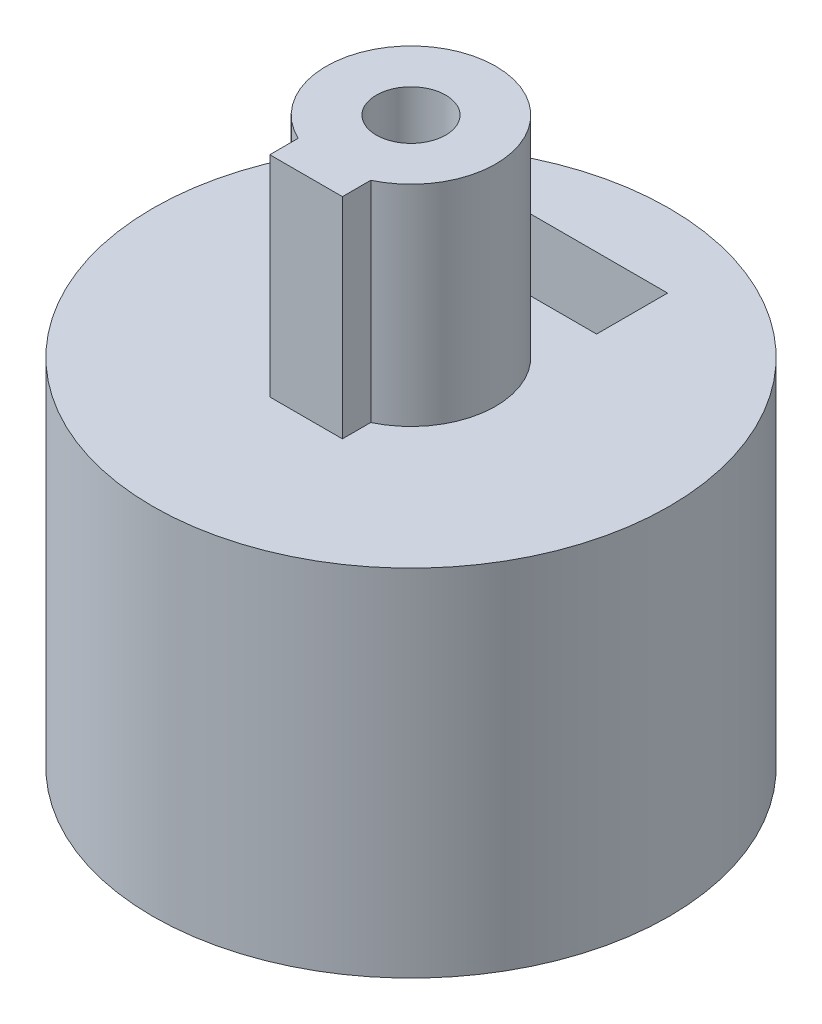
ISO-10303-21;
HEADER;
FILE_DESCRIPTION(('STEP AP214'),'2;1');
FILE_NAME('part.step','',(''),(''),'','','');
FILE_SCHEMA(('AUTOMOTIVE_DESIGN { 1 0 10303 214 1 1 1 1 }'));
ENDSEC;
DATA;
#1=APPLICATION_CONTEXT('core data for automotive mechanical design processes');
#2=APPLICATION_PROTOCOL_DEFINITION('international standard','automotive_design',2000,#1);
#3=PRODUCT_CONTEXT('',#1,'mechanical');
#4=PRODUCT('Part','Part','',(#3));
#5=PRODUCT_RELATED_PRODUCT_CATEGORY('part','',(#4));
#6=PRODUCT_DEFINITION_FORMATION('','',#4);
#7=PRODUCT_DEFINITION_CONTEXT('part definition',#1,'design');
#8=PRODUCT_DEFINITION('design','',#6,#7);
#9=PRODUCT_DEFINITION_SHAPE('','',#8);
#10=(LENGTH_UNIT() NAMED_UNIT(*) SI_UNIT(.MILLI.,.METRE.));
#11=(NAMED_UNIT(*) PLANE_ANGLE_UNIT() SI_UNIT($,.RADIAN.));
#12=(NAMED_UNIT(*) SI_UNIT($,.STERADIAN.) SOLID_ANGLE_UNIT());
#13=UNCERTAINTY_MEASURE_WITH_UNIT(LENGTH_MEASURE(1.E-05),#10,'distance_accuracy_value','');
#14=(GEOMETRIC_REPRESENTATION_CONTEXT(3) GLOBAL_UNCERTAINTY_ASSIGNED_CONTEXT((#13)) GLOBAL_UNIT_ASSIGNED_CONTEXT((#10,
#11,#12)) REPRESENTATION_CONTEXT('',''));
#15=CARTESIAN_POINT('',(0.,0.,0.));
#16=DIRECTION('',(0.,0.,1.));
#17=DIRECTION('',(1.,0.,0.));
#18=AXIS2_PLACEMENT_3D('',#15,#16,#17);
#19=CARTESIAN_POINT('',(0.,7.,-8.));
#20=DIRECTION('',(0.,0.,1.));
#21=DIRECTION('',(1.,0.,0.));
#22=AXIS2_PLACEMENT_3D('',#19,#20,#21);
#23=CYLINDRICAL_SURFACE('',#22,1.075);
#24=CARTESIAN_POINT('',(0.,8.075,-8.));
#25=CARTESIAN_POINT('',(-0.060092794416397,8.0749974716429,-7.99999911181547));
#26=CARTESIAN_POINT('',(-0.120222192972751,8.06994419701879,-7.99931577898279));
#27=CARTESIAN_POINT('',(-0.238805133904426,8.04986697138058,-7.99665557002145));
#28=CARTESIAN_POINT('',(-0.29725690477915,8.03483285792277,-7.99467737549948));
#29=CARTESIAN_POINT('',(-0.410750903373487,7.99524717671987,-7.98965010312977));
#30=CARTESIAN_POINT('',(-0.465795495107335,7.97070229568787,-7.98660177779764));
#31=CARTESIAN_POINT('',(-0.570974704442025,7.91280707597931,-7.97977249916764));
#32=CARTESIAN_POINT('',(-0.621110105394015,7.8794581452991,-7.97599166304299));
#33=CARTESIAN_POINT('',(-0.715374578934897,7.80467629140163,-7.96809215514065));
#34=CARTESIAN_POINT('',(-0.759468116078188,7.7631987590954,-7.96397169531925));
#35=CARTESIAN_POINT('',(-0.840090960456325,7.67343298240961,-7.95587160681168));
#36=CARTESIAN_POINT('',(-0.876619865343444,7.6251443759921,-7.95189198562576));
#37=CARTESIAN_POINT('',(-0.941211112757503,7.52289333607248,-7.9445066814414));
#38=CARTESIAN_POINT('',(-0.96923975909554,7.46890943589338,-7.94110330569616));
#39=CARTESIAN_POINT('',(-1.01581962032494,7.35694724671609,-7.93527976050471));
#40=CARTESIAN_POINT('',(-1.03437124968407,7.29896913252668,-7.9328595480618));
#41=CARTESIAN_POINT('',(-1.06136159068698,7.1810350299197,-7.92929364263999));
#42=CARTESIAN_POINT('',(-1.06986062842502,7.12109308156808,-7.92814034982218));
#43=CARTESIAN_POINT('',(-1.07669127649231,7.00062347246384,-7.92721568300875));
#44=CARTESIAN_POINT('',(-1.07502335732068,6.94009583894456,-7.92744424506463));
#45=CARTESIAN_POINT('',(-1.06161687859971,6.82059545416212,-7.92925050898512));
#46=CARTESIAN_POINT('',(-1.04994502946319,6.76161506442997,-7.93081927358998));
#47=CARTESIAN_POINT('',(-1.01696621809526,6.64645766408446,-7.93511523718938));
#48=CARTESIAN_POINT('',(-0.995659033025943,6.59028071834016,-7.93784246297574));
#49=CARTESIAN_POINT('',(-0.943943504820709,6.48211913483119,-7.94415810307942));
#50=CARTESIAN_POINT('',(-0.91350643259143,6.43014839814982,-7.94774922866829));
#51=CARTESIAN_POINT('',(-0.844415645078879,6.33202690954449,-7.95538599590865));
#52=CARTESIAN_POINT('',(-0.805761495901629,6.28587646515996,-7.95943166155632));
#53=CARTESIAN_POINT('',(-0.72096534034505,6.20031859555403,-7.96756131308648));
#54=CARTESIAN_POINT('',(-0.674765883601231,6.16096809139185,-7.97164534652604));
#55=CARTESIAN_POINT('',(-0.576387641394186,6.09057119789945,-7.97936135707552));
#56=CARTESIAN_POINT('',(-0.524208838232408,6.05952483314996,-7.9829933328473));
#57=CARTESIAN_POINT('',(-0.415307245576307,6.00661645208213,-7.9893987712116));
#58=CARTESIAN_POINT('',(-0.358582559777428,5.98475829259759,-7.99217187315562));
#59=CARTESIAN_POINT('',(-0.242222292292283,5.95089349797181,-7.99654394552587));
#60=CARTESIAN_POINT('',(-0.182586868427062,5.93888632933432,-7.99814297953514));
#61=CARTESIAN_POINT('',(-0.0625898012162963,5.92513880738972,-7.9999784296808));
#62=CARTESIAN_POINT('',(-0.00223728762374069,5.92332009876711,-8.00022524485916));
#63=CARTESIAN_POINT('',(0.117911724838873,5.92979391809772,-7.99935660669511));
#64=CARTESIAN_POINT('',(0.17770823740325,5.93808619634886,-7.9982411869946));
#65=CARTESIAN_POINT('',(0.294814467290954,5.96448148197648,-7.99477986364423));
#66=CARTESIAN_POINT('',(0.352132822198141,5.98254683979153,-7.99243868319097));
#67=CARTESIAN_POINT('',(0.462926687427366,6.02793613444639,-7.98678776857183));
#68=CARTESIAN_POINT('',(0.516402048969415,6.05526042950856,-7.98347799693244));
#69=CARTESIAN_POINT('',(0.618339997276848,6.11857949699144,-7.97623254623426));
#70=CARTESIAN_POINT('',(0.666771056604777,6.15462460803785,-7.9722932801175));
#71=CARTESIAN_POINT('',(0.756924161786225,6.23429130813548,-7.96423996670908));
#72=CARTESIAN_POINT('',(0.798645897904572,6.27791324677686,-7.96012591135936));
#73=CARTESIAN_POINT('',(0.874476563734168,6.37184181892993,-7.95215429437211));
#74=CARTESIAN_POINT('',(0.908533341440052,6.42219073865829,-7.94829860823129));
#75=CARTESIAN_POINT('',(0.967706275855308,6.52794027022739,-7.94131198807677));
#76=CARTESIAN_POINT('',(0.992822634799581,6.58334076776433,-7.93818103766989));
#77=CARTESIAN_POINT('',(1.0333186048018,6.69745709747159,-7.93301147151021));
#78=CARTESIAN_POINT('',(1.04872692328245,6.75616259029887,-7.93096963792837));
#79=CARTESIAN_POINT('',(1.0694615190423,6.87535712142325,-7.92820050841194));
#80=CARTESIAN_POINT('',(1.0747883447589,6.9358460625182,-7.92747314096993));
#81=CARTESIAN_POINT('',(1.07519762316741,7.05637127799591,-7.92741759795498));
#82=CARTESIAN_POINT('',(1.07036202694493,7.11640728526354,-7.92807822936805));
#83=CARTESIAN_POINT('',(1.050758002377,7.23480464678056,-7.93070009140945));
#84=CARTESIAN_POINT('',(1.03598957841016,7.29316600176818,-7.93266132146445));
#85=CARTESIAN_POINT('',(0.996965959588734,7.40654235253583,-7.93765977747413));
#86=CARTESIAN_POINT('',(0.972715350353342,7.46155895101431,-7.94069648325804));
#87=CARTESIAN_POINT('',(0.91542380231593,7.56675546596662,-7.947504501913));
#88=CARTESIAN_POINT('',(0.882382686123591,7.61693528480755,-7.95127582960813));
#89=CARTESIAN_POINT('',(0.808146125167278,7.71145191495493,-7.95916452760708));
#90=CARTESIAN_POINT('',(0.766889712712126,7.7557406401831,-7.96328434404774));
#91=CARTESIAN_POINT('',(0.67752182553316,7.83679674028432,-7.97138462980383));
#92=CARTESIAN_POINT('',(0.62940874594403,7.87356234938242,-7.97536506622362));
#93=CARTESIAN_POINT('',(0.527448401195865,7.93866876757117,-7.98275767966382));
#94=CARTESIAN_POINT('',(0.473576899941764,7.96697189927829,-7.98616728642009));
#95=CARTESIAN_POINT('',(0.36182787795544,8.01408813755674,-7.99200841937768));
#96=CARTESIAN_POINT('',(0.303954714037578,8.03291138594638,-7.99444099026983));
#97=CARTESIAN_POINT('',(0.204829709402752,8.05611056978133,-7.99747850684169));
#98=CARTESIAN_POINT('',(0.164198584988335,8.0631837007631,-7.99841937272592));
#99=CARTESIAN_POINT('',(0.0823840392326397,8.07262926142087,-7.99968042098374));
#100=CARTESIAN_POINT('',(0.0412006228748808,8.07500173348383,-8.00000060895414));
#101=CARTESIAN_POINT('',(0.,8.075,-8.));
#102=B_SPLINE_CURVE_WITH_KNOTS('',3,(#24,#25,#26,#27,#28,#29,#30,#31,#32,#33,#34,#35,#36,#37,
#38,#39,#40,#41,#42,#43,#44,#45,#46,#47,#48,#49,#50,#51,#52,#53,#54,#55,#56,#57,#58,#59,#60,#61,
#62,#63,#64,#65,#66,#67,#68,#69,#70,#71,#72,#73,#74,#75,#76,#77,#78,#79,#80,#81,#82,#83,#84,#85,
#86,#87,#88,#89,#90,#91,#92,#93,#94,#95,#96,#97,#98,#99,#100,#101),.UNSPECIFIED.,.T.,.F.,(4,2,2,
2,2,2,2,2,2,2,2,2,2,2,2,2,2,2,2,2,2,2,2,2,2,2,2,2,2,2,2,2,2,2,2,2,2,2,4),(0.,0.180127870151951,
0.360439427531591,0.540624443034841,0.720780659709491,0.901954738259969,1.08313845062532,
1.26503128422512,1.44691616224436,1.62770391111915,1.80848329369197,1.98806645987638,
2.16765377952108,2.3478122444801,2.52798022487864,2.7095901096786,2.8912005320482,
3.07288711112452,3.25456385002241,3.43484144840973,3.61511459473094,3.79469815607801,
3.97428866619141,4.15494164250128,4.33560295624333,4.51745862813379,4.69931018613403,
4.8806214395816,5.06192282933772,5.24176779339959,5.42161267818159,5.60137069668138,
5.78113234292997,5.9622814074538,6.14347294141388,6.32545957398501,6.50725109687431,
6.6307508848395,6.75424955917242),.UNSPECIFIED.);
#103=CARTESIAN_POINT('',(0.,8.075,-8.));
#104=VERTEX_POINT('',#103);
#105=EDGE_CURVE('E254',#104,#104,#102,.T.);
#106=ORIENTED_EDGE('',*,*,#105,.F.);
#107=EDGE_LOOP('',(#106));
#108=FACE_BOUND('',#107,.T.);
#109=CARTESIAN_POINT('',(0.,7.,-5.7));
#110=DIRECTION('',(0.,0.,1.));
#111=DIRECTION('',(1.,0.,0.));
#112=AXIS2_PLACEMENT_3D('',#109,#110,#111);
#113=CIRCLE('',#112,1.075);
#114=CARTESIAN_POINT('',(1.075,7.,-5.7));
#115=VERTEX_POINT('',#114);
#116=EDGE_CURVE('E189',#115,#115,#113,.F.);
#117=ORIENTED_EDGE('',*,*,#116,.F.);
#118=EDGE_LOOP('',(#117));
#119=FACE_BOUND('',#118,.T.);
#120=ADVANCED_FACE('F52',(#108,#119),#23,.F.);
#121=CARTESIAN_POINT('',(0.,11.,0.));
#122=DIRECTION('',(0.,1.,0.));
#123=DIRECTION('',(0.,0.,1.));
#124=AXIS2_PLACEMENT_3D('',#121,#122,#123);
#125=PLANE('',#124);
#126=DIRECTION('',(0.,0.,1.));
#127=VECTOR('',#126,1.);
#128=CARTESIAN_POINT('',(-1.125,11.,0.));
#129=LINE('',#128,#127);
#130=CARTESIAN_POINT('',(-1.125,11.,2.37170824512628));
#131=VERTEX_POINT('',#130);
#132=CARTESIAN_POINT('',(-1.125,11.,3.25));
#133=VERTEX_POINT('',#132);
#134=EDGE_CURVE('E76',#131,#133,#129,.T.);
#135=ORIENTED_EDGE('',*,*,#134,.F.);
#136=CARTESIAN_POINT('',(0.,11.,0.));
#137=DIRECTION('',(0.,1.,0.));
#138=DIRECTION('',(0.,0.,1.));
#139=AXIS2_PLACEMENT_3D('',#136,#137,#138);
#140=CIRCLE('',#139,2.625);
#141=CARTESIAN_POINT('',(1.125,11.,2.37170824512628));
#142=VERTEX_POINT('',#141);
#143=EDGE_CURVE('E196',#142,#131,#140,.T.);
#144=ORIENTED_EDGE('',*,*,#143,.F.);
#145=DIRECTION('',(0.,0.,1.));
#146=VECTOR('',#145,1.);
#147=CARTESIAN_POINT('',(1.125,11.,0.));
#148=LINE('',#147,#146);
#149=CARTESIAN_POINT('',(1.125,11.,3.25));
#150=VERTEX_POINT('',#149);
#151=EDGE_CURVE('E202',#142,#150,#148,.T.);
#152=ORIENTED_EDGE('',*,*,#151,.T.);
#153=DIRECTION('',(1.,0.,0.));
#154=VECTOR('',#153,1.);
#155=CARTESIAN_POINT('',(0.,11.,3.25));
#156=LINE('',#155,#154);
#157=EDGE_CURVE('E209',#133,#150,#156,.T.);
#158=ORIENTED_EDGE('',*,*,#157,.F.);
#159=EDGE_LOOP('',(#135,#144,#152,#158));
#160=FACE_BOUND('',#159,.T.);
#161=CARTESIAN_POINT('',(0.,11.,0.));
#162=DIRECTION('',(0.,1.,0.));
#163=DIRECTION('',(0.,0.,1.));
#164=AXIS2_PLACEMENT_3D('',#161,#162,#163);
#165=CIRCLE('',#164,8.);
#166=CARTESIAN_POINT('',(0.,11.,8.));
#167=VERTEX_POINT('',#166);
#168=EDGE_CURVE('E224',#167,#167,#165,.T.);
#169=ORIENTED_EDGE('',*,*,#168,.T.);
#170=EDGE_LOOP('',(#169));
#171=FACE_BOUND('',#170,.T.);
#172=DIRECTION('',(0.,0.,-1.));
#173=VECTOR('',#172,1.);
#174=CARTESIAN_POINT('',(-2.25,11.,0.));
#175=LINE('',#174,#173);
#176=CARTESIAN_POINT('',(-2.25,11.,-3.5));
#177=VERTEX_POINT('',#176);
#178=CARTESIAN_POINT('',(-2.25,11.,-5.7));
#179=VERTEX_POINT('',#178);
#180=EDGE_CURVE('E372',#177,#179,#175,.T.);
#181=ORIENTED_EDGE('',*,*,#180,.T.);
#182=DIRECTION('',(1.,0.,0.));
#183=VECTOR('',#182,1.);
#184=CARTESIAN_POINT('',(0.,11.,-5.7));
#185=LINE('',#184,#183);
#186=CARTESIAN_POINT('',(2.25,11.,-5.7));
#187=VERTEX_POINT('',#186);
#188=EDGE_CURVE('E12',#179,#187,#185,.T.);
#189=ORIENTED_EDGE('',*,*,#188,.T.);
#190=DIRECTION('',(0.,0.,-1.));
#191=VECTOR('',#190,1.);
#192=CARTESIAN_POINT('',(2.25,11.,0.));
#193=LINE('',#192,#191);
#194=CARTESIAN_POINT('',(2.25,11.,-3.5));
#195=VERTEX_POINT('',#194);
#196=EDGE_CURVE('E61',#195,#187,#193,.T.);
#197=ORIENTED_EDGE('',*,*,#196,.F.);
#198=DIRECTION('',(1.,0.,0.));
#199=VECTOR('',#198,1.);
#200=CARTESIAN_POINT('',(0.,11.,-3.5));
#201=LINE('',#200,#199);
#202=EDGE_CURVE('E369',#177,#195,#201,.T.);
#203=ORIENTED_EDGE('',*,*,#202,.F.);
#204=EDGE_LOOP('',(#181,#189,#197,#203));
#205=FACE_BOUND('',#204,.T.);
#206=ADVANCED_FACE('F268',(#160,#171,#205),#125,.T.);
#207=CARTESIAN_POINT('',(0.,7.,-3.5));
#208=DIRECTION('',(0.,0.,1.));
#209=DIRECTION('',(1.,0.,0.));
#210=AXIS2_PLACEMENT_3D('',#207,#208,#209);
#211=CIRCLE('',#210,1.075);
#212=CARTESIAN_POINT('',(1.075,7.,-3.5));
#213=VERTEX_POINT('',#212);
#214=EDGE_CURVE('E185',#213,#213,#211,.F.);
#215=ORIENTED_EDGE('',*,*,#214,.T.);
#216=EDGE_LOOP('',(#215));
#217=FACE_BOUND('',#216,.T.);
#218=CARTESIAN_POINT('',(1.075,7.,-2.00499376557634));
#219=CARTESIAN_POINT('',(1.07499658361877,6.94352037809687,-2.0049977706581));
#220=CARTESIAN_POINT('',(1.07051985481672,6.88695900578991,-2.00741574809032));
#221=CARTESIAN_POINT('',(1.05282419906217,6.77553531061269,-2.01675000419458));
#222=CARTESIAN_POINT('',(1.0395849365136,6.72067725147344,-2.02367674593407));
#223=CARTESIAN_POINT('',(1.00503753676983,6.61447764296661,-2.04105190266438));
#224=CARTESIAN_POINT('',(0.983768735298126,6.56312036888871,-2.05148312265038));
#225=CARTESIAN_POINT('',(0.93388521183156,6.46471537598709,-2.07466560794858));
#226=CARTESIAN_POINT('',(0.905270800115793,6.41766747524901,-2.0874167752594));
#227=CARTESIAN_POINT('',(0.839046224804819,6.32540208389258,-2.11494734394164));
#228=CARTESIAN_POINT('',(0.800930673150271,6.28057107594533,-2.12980689566071));
#229=CARTESIAN_POINT('',(0.71784039306809,6.19764232605115,-2.15922964515003));
#230=CARTESIAN_POINT('',(0.672862556988997,6.15954765167811,-2.17379270524734));
#231=CARTESIAN_POINT('',(0.574096126088812,6.0889941954935,-2.20200460628538));
#232=CARTESIAN_POINT('',(0.51994555627536,6.05699682556436,-2.21554977860469));
#233=CARTESIAN_POINT('',(0.406271271855638,6.00273968867275,-2.23918056084756));
#234=CARTESIAN_POINT('',(0.346750617098963,5.98047441815296,-2.24926812536946));
#235=CARTESIAN_POINT('',(0.228108268458676,5.94779823494566,-2.26427296932229));
#236=CARTESIAN_POINT('',(0.169209918374028,5.93671355249755,-2.26948253755475));
#237=CARTESIAN_POINT('',(0.0501756923304657,5.92450876883154,-2.27522536958065));
#238=CARTESIAN_POINT('',(-0.00995950747421294,5.92338336101428,-2.27576112371986));
#239=CARTESIAN_POINT('',(-0.124753974480553,5.93083628273936,-2.27224643987149));
#240=CARTESIAN_POINT('',(-0.179475005720044,5.93866579956152,-2.26854988323864));
#241=CARTESIAN_POINT('',(-0.286718588761961,5.96248605619345,-2.25750397557095));
#242=CARTESIAN_POINT('',(-0.33924097683198,5.9784774026469,-2.25015435301602));
#243=CARTESIAN_POINT('',(-0.441554827354227,6.01831052326573,-2.23235148360207));
#244=CARTESIAN_POINT('',(-0.49129446474757,6.04226481374099,-2.22185397840715));
#245=CARTESIAN_POINT('',(-0.586175402723223,6.09720873205379,-2.19872954500003));
#246=CARTESIAN_POINT('',(-0.631315010607889,6.12820093622425,-2.18610183743199));
#247=CARTESIAN_POINT('',(-0.719886613078505,6.19944250065705,-2.15863854746812));
#248=CARTESIAN_POINT('',(-0.7628308990752,6.24026163344897,-2.14370646276313));
#249=CARTESIAN_POINT('',(-0.841511074695959,6.32844984411755,-2.11406136073225));
#250=CARTESIAN_POINT('',(-0.877242436828807,6.37582300465857,-2.09934848633533));
#251=CARTESIAN_POINT('',(-0.942280406152763,6.47881857548984,-2.07100402455298));
#252=CARTESIAN_POINT('',(-0.971156378892116,6.53474182667014,-2.05746842957346));
#253=CARTESIAN_POINT('',(-1.0188746622517,6.6514544678604,-2.03426426506451));
#254=CARTESIAN_POINT('',(-1.03772642303789,6.71223921234676,-2.0245920555386));
#255=CARTESIAN_POINT('',(-1.06343409132714,6.83207686747855,-2.0112009733404));
#256=CARTESIAN_POINT('',(-1.07108995187181,6.8909126359256,-2.00708691025632));
#257=CARTESIAN_POINT('',(-1.07658655624566,7.00915928186688,-2.00414552042917));
#258=CARTESIAN_POINT('',(-1.07443271470559,7.06856982403745,-2.00531527718954));
#259=CARTESIAN_POINT('',(-1.06110471902395,7.18044537910263,-2.01239324621807));
#260=CARTESIAN_POINT('',(-1.05078321756229,7.23304458857963,-2.01785322418241));
#261=CARTESIAN_POINT('',(-1.02263077816888,7.33568593033835,-2.03226460173223));
#262=CARTESIAN_POINT('',(-1.00479769707382,7.38572732826628,-2.04121699770167));
#263=CARTESIAN_POINT('',(-0.961241943776019,7.48444173717355,-2.06209739944632));
#264=CARTESIAN_POINT('',(-0.935192961201697,7.53294483838103,-2.07414372698382));
#265=CARTESIAN_POINT('',(-0.876241224937739,7.62515973038128,-2.09972811922533));
#266=CARTESIAN_POINT('',(-0.843335051968267,7.66886911416816,-2.11326692654936));
#267=CARTESIAN_POINT('',(-0.767358308352441,7.75528067691271,-2.14210429596524));
#268=CARTESIAN_POINT('',(-0.723567675570702,7.79734265974701,-2.15743255182857));
#269=CARTESIAN_POINT('',(-0.629259383115979,7.8736926329007,-2.18680028603334));
#270=CARTESIAN_POINT('',(-0.578740179529363,7.90797883412249,-2.20083946733561));
#271=CARTESIAN_POINT('',(-0.471184745044899,7.96822972786095,-2.22636713797464));
#272=CARTESIAN_POINT('',(-0.414054729624578,7.99404776659325,-2.23780971411247));
#273=CARTESIAN_POINT('',(-0.29556891973965,8.03546801010164,-2.25651273696619));
#274=CARTESIAN_POINT('',(-0.234216474110518,8.05107820989504,-2.26377645612285));
#275=CARTESIAN_POINT('',(-0.114659241019512,8.07043404997335,-2.27283168138583));
#276=CARTESIAN_POINT('',(-0.0566301928492878,8.07507541792166,-2.27503585617896));
#277=CARTESIAN_POINT('',(0.0594048791562423,8.07492279198013,-2.27496329801195));
#278=CARTESIAN_POINT('',(0.117410904895417,8.07013143309525,-2.27268781643086));
#279=CARTESIAN_POINT('',(0.228437139740304,8.05187203258533,-2.26415009403731));
#280=CARTESIAN_POINT('',(0.281556605611876,8.0388923185585,-2.25811245053978));
#281=CARTESIAN_POINT('',(0.384800886986935,8.00523773908891,-2.24282830588852));
#282=CARTESIAN_POINT('',(0.434925224571048,7.9845616493546,-2.2335812942243));
#283=CARTESIAN_POINT('',(0.533273794020516,7.93509890517152,-2.21221399085242));
#284=CARTESIAN_POINT('',(0.581310579968736,7.90598871641568,-2.19998298698338));
#285=CARTESIAN_POINT('',(0.672026729836986,7.84090727092433,-2.17399067453018));
#286=CARTESIAN_POINT('',(0.71470364611605,7.80493289834196,-2.16022867217004));
#287=CARTESIAN_POINT('',(0.797499262336585,7.7233887666038,-2.13112967505797));
#288=CARTESIAN_POINT('',(0.837046873765155,7.67724829887593,-2.11576197956525));
#289=CARTESIAN_POINT('',(0.908005555387062,7.57865457131097,-2.08629609065312));
#290=CARTESIAN_POINT('',(0.939410643983241,7.52619671183536,-2.07219883544656));
#291=CARTESIAN_POINT('',(0.993530505876132,7.41520623881881,-2.04681061621627));
#292=CARTESIAN_POINT('',(1.01609518975948,7.35658850242082,-2.0355691715913));
#293=CARTESIAN_POINT('',(1.05070153355639,7.23573865117137,-2.01792946864943));
#294=CARTESIAN_POINT('',(1.06277852037696,7.17351942911748,-2.01151496103282));
#295=CARTESIAN_POINT('',(1.07119037590385,7.09230433500277,-2.00703202473711));
#296=CARTESIAN_POINT('',(1.0726172324136,7.07388377145361,-2.00626975664607));
#297=CARTESIAN_POINT('',(1.07452262792992,7.03697839572768,-2.00524995850825));
#298=CARTESIAN_POINT('',(1.07500111865339,7.01849358032772,-2.00499245415996));
#299=CARTESIAN_POINT('',(1.075,7.,-2.00499376557634));
#300=B_SPLINE_CURVE_WITH_KNOTS('',3,(#218,#219,#220,#221,#222,#223,#224,#225,#226,#227,#228,
#229,#230,#231,#232,#233,#234,#235,#236,#237,#238,#239,#240,#241,#242,#243,#244,#245,#246,#247,
#248,#249,#250,#251,#252,#253,#254,#255,#256,#257,#258,#259,#260,#261,#262,#263,#264,#265,#266,
#267,#268,#269,#270,#271,#272,#273,#274,#275,#276,#277,#278,#279,#280,#281,#282,#283,#284,#285,
#286,#287,#288,#289,#290,#291,#292,#293,#294,#295,#296,#297,#298,#299),.UNSPECIFIED.,.T.,.F.,(4,
2,2,2,2,2,2,2,2,2,2,2,2,2,2,2,2,2,2,2,2,2,2,2,2,2,2,2,2,2,2,2,2,2,2,2,2,2,2,2,4),(0.,
0.169361138035443,0.339116704556781,0.508051229186817,0.676978619184486,0.858279295173719,
1.03966231996277,1.23168036899097,1.42358968979281,1.60308253667038,1.78247973862864,
1.94790715114597,2.11334686116485,2.28123132772306,2.44917735023813,2.63169043998003,
2.81431773783549,3.00644038715383,3.19838159334542,3.37579501751972,3.5531105272295,
3.71402727109224,3.87498995798282,4.04338589524176,4.21186600350035,4.39888716973171,
4.58595132333593,4.77610232186768,4.966104210758,5.13995544816866,5.31375812762987,
5.47806557166228,5.64239916387788,5.81413902375453,5.98595702746548,6.17315738195808,
6.36049486896152,6.55088775539554,6.7406368040817,6.79608927094458,6.85154456092552),.UNSPECIFIED.);
#301=CARTESIAN_POINT('',(1.075,7.,-2.00499376557634));
#302=VERTEX_POINT('',#301);
#303=EDGE_CURVE('E247',#302,#302,#300,.T.);
#304=ORIENTED_EDGE('',*,*,#303,.F.);
#305=EDGE_LOOP('',(#304));
#306=FACE_BOUND('',#305,.T.);
#307=ADVANCED_FACE('F265',(#217,#306),#23,.F.);
#308=CARTESIAN_POINT('',(0.,10.,0.));
#309=DIRECTION('',(0.,-1.,0.));
#310=DIRECTION('',(0.,0.,-1.));
#311=AXIS2_PLACEMENT_3D('',#308,#309,#310);
#312=CYLINDRICAL_SURFACE('',#311,8.);
#313=ORIENTED_EDGE('',*,*,#105,.T.);
#314=EDGE_LOOP('',(#313));
#315=FACE_BOUND('',#314,.T.);
#316=CARTESIAN_POINT('',(0.,0.,0.));
#317=DIRECTION('',(0.,1.,0.));
#318=DIRECTION('',(0.,0.,1.));
#319=AXIS2_PLACEMENT_3D('',#316,#317,#318);
#320=CIRCLE('',#319,8.);
#321=CARTESIAN_POINT('',(0.,0.,8.));
#322=VERTEX_POINT('',#321);
#323=EDGE_CURVE('E251',#322,#322,#320,.T.);
#324=ORIENTED_EDGE('',*,*,#323,.T.);
#325=EDGE_LOOP('',(#324));
#326=FACE_BOUND('',#325,.T.);
#327=ORIENTED_EDGE('',*,*,#168,.F.);
#328=EDGE_LOOP('',(#327));
#329=FACE_BOUND('',#328,.T.);
#330=ADVANCED_FACE('F54',(#315,#326,#329),#312,.T.);
#331=CARTESIAN_POINT('',(0.,0.,0.));
#332=DIRECTION('',(0.,1.,0.));
#333=DIRECTION('',(0.,0.,1.));
#334=AXIS2_PLACEMENT_3D('',#331,#332,#333);
#335=PLANE('',#334);
#336=CARTESIAN_POINT('',(0.,0.,0.));
#337=DIRECTION('',(0.,1.,0.));
#338=DIRECTION('',(0.,0.,1.));
#339=AXIS2_PLACEMENT_3D('',#336,#337,#338);
#340=CIRCLE('',#339,2.275);
#341=CARTESIAN_POINT('',(0.,0.,2.275));
#342=VERTEX_POINT('',#341);
#343=EDGE_CURVE('E239',#342,#342,#340,.T.);
#344=ORIENTED_EDGE('',*,*,#343,.T.);
#345=EDGE_LOOP('',(#344));
#346=FACE_BOUND('',#345,.T.);
#347=ORIENTED_EDGE('',*,*,#323,.F.);
#348=EDGE_LOOP('',(#347));
#349=FACE_BOUND('',#348,.T.);
#350=ADVANCED_FACE('F273',(#346,#349),#335,.F.);
#351=CARTESIAN_POINT('',(0.,10.,0.));
#352=DIRECTION('',(0.,-1.,0.));
#353=DIRECTION('',(0.,0.,-1.));
#354=AXIS2_PLACEMENT_3D('',#351,#352,#353);
#355=CYLINDRICAL_SURFACE('',#354,2.275);
#356=DIRECTION('',(0.,-1.,0.));
#357=VECTOR('',#356,1.);
#358=CARTESIAN_POINT('',(0.475,10.,2.2248595461287));
#359=LINE('',#358,#357);
#360=CARTESIAN_POINT('',(0.475,10.,2.2248595461287));
#361=VERTEX_POINT('',#360);
#362=CARTESIAN_POINT('',(0.475,8.8,2.2248595461287));
#363=VERTEX_POINT('',#362);
#364=EDGE_CURVE('E361',#361,#363,#359,.T.);
#365=ORIENTED_EDGE('',*,*,#364,.F.);
#366=CARTESIAN_POINT('',(0.,10.,0.));
#367=DIRECTION('',(0.,1.,0.));
#368=DIRECTION('',(0.,0.,1.));
#369=AXIS2_PLACEMENT_3D('',#366,#367,#368);
#370=CIRCLE('',#369,2.275);
#371=CARTESIAN_POINT('',(0.475,10.,-2.2248595461287));
#372=VERTEX_POINT('',#371);
#373=EDGE_CURVE('E244',#361,#372,#370,.T.);
#374=ORIENTED_EDGE('',*,*,#373,.T.);
#375=DIRECTION('',(0.,-1.,0.));
#376=VECTOR('',#375,1.);
#377=CARTESIAN_POINT('',(0.475,10.,-2.2248595461287));
#378=LINE('',#377,#376);
#379=CARTESIAN_POINT('',(0.475,8.8,-2.2248595461287));
#380=VERTEX_POINT('',#379);
#381=EDGE_CURVE('E363',#380,#372,#378,.F.);
#382=ORIENTED_EDGE('',*,*,#381,.F.);
#383=CARTESIAN_POINT('',(0.,8.8,0.));
#384=DIRECTION('',(0.,-1.,0.));
#385=DIRECTION('',(0.,0.,-1.));
#386=AXIS2_PLACEMENT_3D('',#383,#384,#385);
#387=CIRCLE('',#386,2.275);
#388=CARTESIAN_POINT('',(-0.475,8.8,-2.2248595461287));
#389=VERTEX_POINT('',#388);
#390=EDGE_CURVE('E260',#389,#380,#387,.T.);
#391=ORIENTED_EDGE('',*,*,#390,.F.);
#392=DIRECTION('',(0.,-1.,0.));
#393=VECTOR('',#392,1.);
#394=CARTESIAN_POINT('',(-0.475,10.,-2.2248595461287));
#395=LINE('',#394,#393);
#396=CARTESIAN_POINT('',(-0.475,10.,-2.2248595461287));
#397=VERTEX_POINT('',#396);
#398=EDGE_CURVE('E390',#397,#389,#395,.T.);
#399=ORIENTED_EDGE('',*,*,#398,.F.);
#400=CARTESIAN_POINT('',(-0.475,10.,2.2248595461287));
#401=VERTEX_POINT('',#400);
#402=EDGE_CURVE('E248',#397,#401,#370,.T.);
#403=ORIENTED_EDGE('',*,*,#402,.T.);
#404=DIRECTION('',(0.,-1.,0.));
#405=VECTOR('',#404,1.);
#406=CARTESIAN_POINT('',(-0.475,10.,2.2248595461287));
#407=LINE('',#406,#405);
#408=CARTESIAN_POINT('',(-0.475,8.8,2.2248595461287));
#409=VERTEX_POINT('',#408);
#410=EDGE_CURVE('E370',#409,#401,#407,.F.);
#411=ORIENTED_EDGE('',*,*,#410,.F.);
#412=EDGE_CURVE('E368',#363,#409,#387,.T.);
#413=ORIENTED_EDGE('',*,*,#412,.F.);
#414=EDGE_LOOP('',(#365,#374,#382,#391,#399,#403,#411,#413));
#415=FACE_BOUND('',#414,.T.);
#416=ORIENTED_EDGE('',*,*,#343,.F.);
#417=EDGE_LOOP('',(#416));
#418=FACE_BOUND('',#417,.T.);
#419=ORIENTED_EDGE('',*,*,#303,.T.);
#420=EDGE_LOOP('',(#419));
#421=FACE_BOUND('',#420,.T.);
#422=ADVANCED_FACE('F270',(#415,#418,#421),#355,.F.);
#423=CARTESIAN_POINT('',(0.,8.8,0.));
#424=DIRECTION('',(0.,-1.,0.));
#425=DIRECTION('',(0.,0.,-1.));
#426=AXIS2_PLACEMENT_3D('',#423,#424,#425);
#427=PLANE('',#426);
#428=DIRECTION('',(0.,0.,-1.));
#429=VECTOR('',#428,1.);
#430=CARTESIAN_POINT('',(0.475,8.8,3.53457335348961));
#431=LINE('',#430,#429);
#432=EDGE_CURVE('E232',#363,#380,#431,.T.);
#433=ORIENTED_EDGE('',*,*,#432,.F.);
#434=ORIENTED_EDGE('',*,*,#412,.T.);
#435=DIRECTION('',(0.,0.,1.));
#436=VECTOR('',#435,1.);
#437=CARTESIAN_POINT('',(-0.475,8.8,3.53457335348961));
#438=LINE('',#437,#436);
#439=EDGE_CURVE('E235',#389,#409,#438,.T.);
#440=ORIENTED_EDGE('',*,*,#439,.F.);
#441=ORIENTED_EDGE('',*,*,#390,.T.);
#442=EDGE_LOOP('',(#433,#434,#440,#441));
#443=FACE_BOUND('',#442,.T.);
#444=ADVANCED_FACE('F281',(#443),#427,.T.);
#445=CARTESIAN_POINT('',(0.475,8.8,3.53457335348961));
#446=DIRECTION('',(1.,0.,0.));
#447=DIRECTION('',(0.,0.,-1.));
#448=AXIS2_PLACEMENT_3D('',#445,#446,#447);
#449=PLANE('',#448);
#450=DIRECTION('',(0.,0.,-1.));
#451=VECTOR('',#450,1.);
#452=CARTESIAN_POINT('',(0.475,10.,3.53457335348961));
#453=LINE('',#452,#451);
#454=EDGE_CURVE('E231',#361,#372,#453,.T.);
#455=ORIENTED_EDGE('',*,*,#454,.F.);
#456=ORIENTED_EDGE('',*,*,#364,.T.);
#457=ORIENTED_EDGE('',*,*,#432,.T.);
#458=ORIENTED_EDGE('',*,*,#381,.T.);
#459=EDGE_LOOP('',(#455,#456,#457,#458));
#460=FACE_BOUND('',#459,.T.);
#461=ADVANCED_FACE('F350',(#460),#449,.T.);
#462=CARTESIAN_POINT('',(-0.475,8.8,3.53457335348961));
#463=DIRECTION('',(-1.,0.,0.));
#464=DIRECTION('',(0.,0.,1.));
#465=AXIS2_PLACEMENT_3D('',#462,#463,#464);
#466=PLANE('',#465);
#467=DIRECTION('',(0.,0.,1.));
#468=VECTOR('',#467,1.);
#469=CARTESIAN_POINT('',(-0.475,10.,3.53457335348961));
#470=LINE('',#469,#468);
#471=EDGE_CURVE('E236',#397,#401,#470,.T.);
#472=ORIENTED_EDGE('',*,*,#471,.F.);
#473=ORIENTED_EDGE('',*,*,#398,.T.);
#474=ORIENTED_EDGE('',*,*,#439,.T.);
#475=ORIENTED_EDGE('',*,*,#410,.T.);
#476=EDGE_LOOP('',(#472,#473,#474,#475));
#477=FACE_BOUND('',#476,.T.);
#478=ADVANCED_FACE('F346',(#477),#466,.T.);
#479=CARTESIAN_POINT('',(0.,10.,0.));
#480=DIRECTION('',(0.,1.,0.));
#481=DIRECTION('',(0.,0.,1.));
#482=AXIS2_PLACEMENT_3D('',#479,#480,#481);
#483=PLANE('',#482);
#484=ORIENTED_EDGE('',*,*,#402,.F.);
#485=ORIENTED_EDGE('',*,*,#471,.T.);
#486=EDGE_LOOP('',(#484,#485));
#487=FACE_BOUND('',#486,.T.);
#488=ADVANCED_FACE('F343',(#487),#483,.F.);
#489=ORIENTED_EDGE('',*,*,#373,.F.);
#490=ORIENTED_EDGE('',*,*,#454,.T.);
#491=EDGE_LOOP('',(#489,#490));
#492=FACE_BOUND('',#491,.T.);
#493=ADVANCED_FACE('F338',(#492),#483,.F.);
#494=CARTESIAN_POINT('',(-1.125,17.5,0.));
#495=DIRECTION('',(1.,0.,0.));
#496=DIRECTION('',(0.,0.,-1.));
#497=AXIS2_PLACEMENT_3D('',#494,#495,#496);
#498=PLANE('',#497);
#499=ORIENTED_EDGE('',*,*,#134,.T.);
#500=DIRECTION('',(0.,-1.,0.));
#501=VECTOR('',#500,1.);
#502=CARTESIAN_POINT('',(-1.125,17.5,3.25));
#503=LINE('',#502,#501);
#504=CARTESIAN_POINT('',(-1.125,17.5,3.25));
#505=VERTEX_POINT('',#504);
#506=EDGE_CURVE('E219',#505,#133,#503,.T.);
#507=ORIENTED_EDGE('',*,*,#506,.F.);
#508=DIRECTION('',(0.,0.,1.));
#509=VECTOR('',#508,1.);
#510=CARTESIAN_POINT('',(-1.125,17.5,0.));
#511=LINE('',#510,#509);
#512=CARTESIAN_POINT('',(-1.125,17.5,2.37170824512628));
#513=VERTEX_POINT('',#512);
#514=EDGE_CURVE('E199',#513,#505,#511,.T.);
#515=ORIENTED_EDGE('',*,*,#514,.F.);
#516=DIRECTION('',(0.,-1.,0.));
#517=VECTOR('',#516,1.);
#518=CARTESIAN_POINT('',(-1.125,17.5,2.37170824512628));
#519=LINE('',#518,#517);
#520=EDGE_CURVE('E222',#513,#131,#519,.T.);
#521=ORIENTED_EDGE('',*,*,#520,.T.);
#522=EDGE_LOOP('',(#499,#507,#515,#521));
#523=FACE_BOUND('',#522,.T.);
#524=ADVANCED_FACE('F334',(#523),#498,.F.);
#525=CARTESIAN_POINT('',(0.,17.5,3.25));
#526=DIRECTION('',(0.,0.,-1.));
#527=DIRECTION('',(-1.,0.,0.));
#528=AXIS2_PLACEMENT_3D('',#525,#526,#527);
#529=PLANE('',#528);
#530=ORIENTED_EDGE('',*,*,#157,.T.);
#531=DIRECTION('',(0.,-1.,0.));
#532=VECTOR('',#531,1.);
#533=CARTESIAN_POINT('',(1.125,17.5,3.25));
#534=LINE('',#533,#532);
#535=CARTESIAN_POINT('',(1.125,17.5,3.25));
#536=VERTEX_POINT('',#535);
#537=EDGE_CURVE('E216',#536,#150,#534,.T.);
#538=ORIENTED_EDGE('',*,*,#537,.F.);
#539=DIRECTION('',(1.,0.,0.));
#540=VECTOR('',#539,1.);
#541=CARTESIAN_POINT('',(0.,17.5,3.25));
#542=LINE('',#541,#540);
#543=EDGE_CURVE('E201',#505,#536,#542,.T.);
#544=ORIENTED_EDGE('',*,*,#543,.F.);
#545=ORIENTED_EDGE('',*,*,#506,.T.);
#546=EDGE_LOOP('',(#530,#538,#544,#545));
#547=FACE_BOUND('',#546,.T.);
#548=ADVANCED_FACE('F330',(#547),#529,.F.);
#549=CARTESIAN_POINT('',(1.125,17.5,0.));
#550=DIRECTION('',(1.,0.,0.));
#551=DIRECTION('',(0.,0.,-1.));
#552=AXIS2_PLACEMENT_3D('',#549,#550,#551);
#553=PLANE('',#552);
#554=ORIENTED_EDGE('',*,*,#151,.F.);
#555=DIRECTION('',(0.,-1.,0.));
#556=VECTOR('',#555,1.);
#557=CARTESIAN_POINT('',(1.125,17.5,2.37170824512628));
#558=LINE('',#557,#556);
#559=CARTESIAN_POINT('',(1.125,17.5,2.37170824512628));
#560=VERTEX_POINT('',#559);
#561=EDGE_CURVE('E207',#560,#142,#558,.T.);
#562=ORIENTED_EDGE('',*,*,#561,.F.);
#563=DIRECTION('',(0.,0.,1.));
#564=VECTOR('',#563,1.);
#565=CARTESIAN_POINT('',(1.125,17.5,0.));
#566=LINE('',#565,#564);
#567=EDGE_CURVE('E204',#560,#536,#566,.T.);
#568=ORIENTED_EDGE('',*,*,#567,.T.);
#569=ORIENTED_EDGE('',*,*,#537,.T.);
#570=EDGE_LOOP('',(#554,#562,#568,#569));
#571=FACE_BOUND('',#570,.T.);
#572=ADVANCED_FACE('F326',(#571),#553,.T.);
#573=CARTESIAN_POINT('',(0.,17.5,0.));
#574=DIRECTION('',(0.,1.,0.));
#575=DIRECTION('',(0.,0.,1.));
#576=AXIS2_PLACEMENT_3D('',#573,#574,#575);
#577=PLANE('',#576);
#578=CARTESIAN_POINT('',(0.,17.5,0.));
#579=DIRECTION('',(0.,1.,0.));
#580=DIRECTION('',(0.,0.,1.));
#581=AXIS2_PLACEMENT_3D('',#578,#579,#580);
#582=CIRCLE('',#581,1.075);
#583=CARTESIAN_POINT('',(0.,17.5,1.075));
#584=VERTEX_POINT('',#583);
#585=EDGE_CURVE('E192',#584,#584,#582,.T.);
#586=ORIENTED_EDGE('',*,*,#585,.F.);
#587=EDGE_LOOP('',(#586));
#588=FACE_BOUND('',#587,.T.);
#589=ORIENTED_EDGE('',*,*,#567,.F.);
#590=CARTESIAN_POINT('',(0.,17.5,0.));
#591=DIRECTION('',(0.,1.,0.));
#592=DIRECTION('',(0.,0.,1.));
#593=AXIS2_PLACEMENT_3D('',#590,#591,#592);
#594=CIRCLE('',#593,2.625);
#595=EDGE_CURVE('E210',#560,#513,#594,.T.);
#596=ORIENTED_EDGE('',*,*,#595,.T.);
#597=ORIENTED_EDGE('',*,*,#514,.T.);
#598=ORIENTED_EDGE('',*,*,#543,.T.);
#599=EDGE_LOOP('',(#589,#596,#597,#598));
#600=FACE_BOUND('',#599,.T.);
#601=ADVANCED_FACE('F323',(#588,#600),#577,.T.);
#602=CARTESIAN_POINT('',(0.,17.5,0.));
#603=DIRECTION('',(0.,-1.,0.));
#604=DIRECTION('',(0.,0.,-1.));
#605=AXIS2_PLACEMENT_3D('',#602,#603,#604);
#606=CYLINDRICAL_SURFACE('',#605,2.625);
#607=ORIENTED_EDGE('',*,*,#143,.T.);
#608=ORIENTED_EDGE('',*,*,#520,.F.);
#609=ORIENTED_EDGE('',*,*,#595,.F.);
#610=ORIENTED_EDGE('',*,*,#561,.T.);
#611=EDGE_LOOP('',(#607,#608,#609,#610));
#612=FACE_BOUND('',#611,.T.);
#613=ADVANCED_FACE('F321',(#612),#606,.T.);
#614=CARTESIAN_POINT('',(0.,11.5,0.));
#615=DIRECTION('',(0.,1.,0.));
#616=DIRECTION('',(0.,0.,1.));
#617=AXIS2_PLACEMENT_3D('',#614,#615,#616);
#618=CYLINDRICAL_SURFACE('',#617,1.075);
#619=CARTESIAN_POINT('',(0.,11.5,0.));
#620=DIRECTION('',(0.,1.,0.));
#621=DIRECTION('',(0.,0.,1.));
#622=AXIS2_PLACEMENT_3D('',#619,#620,#621);
#623=CIRCLE('',#622,1.075);
#624=CARTESIAN_POINT('',(0.,11.5,1.075));
#625=VERTEX_POINT('',#624);
#626=EDGE_CURVE('E193',#625,#625,#623,.T.);
#627=ORIENTED_EDGE('',*,*,#626,.F.);
#628=EDGE_LOOP('',(#627));
#629=FACE_BOUND('',#628,.T.);
#630=ORIENTED_EDGE('',*,*,#585,.T.);
#631=EDGE_LOOP('',(#630));
#632=FACE_BOUND('',#631,.T.);
#633=ADVANCED_FACE('F304',(#629,#632),#618,.F.);
#634=CARTESIAN_POINT('',(0.,11.5,0.));
#635=DIRECTION('',(0.,1.,0.));
#636=DIRECTION('',(0.,0.,1.));
#637=AXIS2_PLACEMENT_3D('',#634,#635,#636);
#638=PLANE('',#637);
#639=ORIENTED_EDGE('',*,*,#626,.T.);
#640=EDGE_LOOP('',(#639));
#641=FACE_BOUND('',#640,.T.);
#642=ADVANCED_FACE('F296',(#641),#638,.T.);
#643=CARTESIAN_POINT('',(0.,0.,-5.7));
#644=DIRECTION('',(0.,0.,1.));
#645=DIRECTION('',(1.,0.,0.));
#646=AXIS2_PLACEMENT_3D('',#643,#644,#645);
#647=PLANE('',#646);
#648=DIRECTION('',(0.,1.,0.));
#649=VECTOR('',#648,1.);
#650=CARTESIAN_POINT('',(-2.25,0.,-5.7));
#651=LINE('',#650,#649);
#652=CARTESIAN_POINT('',(-2.25,5.70096189432334,-5.7));
#653=VERTEX_POINT('',#652);
#654=EDGE_CURVE('E151',#653,#179,#651,.T.);
#655=ORIENTED_EDGE('',*,*,#654,.F.);
#656=DIRECTION('',(0.866025403784439,-0.5,0.));
#657=VECTOR('',#656,1.);
#658=CARTESIAN_POINT('',(1.90608891324554,3.30144284148502,-5.7));
#659=LINE('',#658,#657);
#660=CARTESIAN_POINT('',(0.,4.40192378864669,-5.7));
#661=VERTEX_POINT('',#660);
#662=EDGE_CURVE('E164',#653,#661,#659,.T.);
#663=ORIENTED_EDGE('',*,*,#662,.T.);
#664=DIRECTION('',(0.866025403784438,0.5,0.));
#665=VECTOR('',#664,1.);
#666=CARTESIAN_POINT('',(-1.90608891324554,3.30144284148501,-5.7));
#667=LINE('',#666,#665);
#668=CARTESIAN_POINT('',(2.25,5.70096189432335,-5.7));
#669=VERTEX_POINT('',#668);
#670=EDGE_CURVE('E170',#661,#669,#667,.T.);
#671=ORIENTED_EDGE('',*,*,#670,.T.);
#672=DIRECTION('',(0.,1.,0.));
#673=VECTOR('',#672,1.);
#674=CARTESIAN_POINT('',(2.25,0.,-5.7));
#675=LINE('',#674,#673);
#676=EDGE_CURVE('E157',#669,#187,#675,.T.);
#677=ORIENTED_EDGE('',*,*,#676,.T.);
#678=ORIENTED_EDGE('',*,*,#188,.F.);
#679=EDGE_LOOP('',(#655,#663,#671,#677,#678));
#680=FACE_BOUND('',#679,.T.);
#681=ORIENTED_EDGE('',*,*,#116,.T.);
#682=EDGE_LOOP('',(#681));
#683=FACE_BOUND('',#682,.T.);
#684=ADVANCED_FACE('F161',(#680,#683),#647,.T.);
#685=CARTESIAN_POINT('',(0.,0.,-3.5));
#686=DIRECTION('',(0.,0.,1.));
#687=DIRECTION('',(1.,0.,0.));
#688=AXIS2_PLACEMENT_3D('',#685,#686,#687);
#689=PLANE('',#688);
#690=ORIENTED_EDGE('',*,*,#202,.T.);
#691=DIRECTION('',(0.,1.,0.));
#692=VECTOR('',#691,1.);
#693=CARTESIAN_POINT('',(2.25,0.,-3.5));
#694=LINE('',#693,#692);
#695=CARTESIAN_POINT('',(2.25,5.70096189432335,-3.5));
#696=VERTEX_POINT('',#695);
#697=EDGE_CURVE('E166',#696,#195,#694,.T.);
#698=ORIENTED_EDGE('',*,*,#697,.F.);
#699=DIRECTION('',(0.866025403784438,0.5,0.));
#700=VECTOR('',#699,1.);
#701=CARTESIAN_POINT('',(-1.90608891324554,3.30144284148501,-3.5));
#702=LINE('',#701,#700);
#703=CARTESIAN_POINT('',(0.,4.40192378864669,-3.5));
#704=VERTEX_POINT('',#703);
#705=EDGE_CURVE('E178',#704,#696,#702,.T.);
#706=ORIENTED_EDGE('',*,*,#705,.F.);
#707=DIRECTION('',(0.866025403784439,-0.5,0.));
#708=VECTOR('',#707,1.);
#709=CARTESIAN_POINT('',(1.90608891324554,3.30144284148502,-3.5));
#710=LINE('',#709,#708);
#711=CARTESIAN_POINT('',(-2.25,5.70096189432334,-3.5));
#712=VERTEX_POINT('',#711);
#713=EDGE_CURVE('E176',#712,#704,#710,.T.);
#714=ORIENTED_EDGE('',*,*,#713,.F.);
#715=DIRECTION('',(0.,1.,0.));
#716=VECTOR('',#715,1.);
#717=CARTESIAN_POINT('',(-2.25,0.,-3.5));
#718=LINE('',#717,#716);
#719=EDGE_CURVE('E68',#712,#177,#718,.T.);
#720=ORIENTED_EDGE('',*,*,#719,.T.);
#721=EDGE_LOOP('',(#690,#698,#706,#714,#720));
#722=FACE_BOUND('',#721,.T.);
#723=ORIENTED_EDGE('',*,*,#214,.F.);
#724=EDGE_LOOP('',(#723));
#725=FACE_BOUND('',#724,.T.);
#726=ADVANCED_FACE('F295',(#722,#725),#689,.F.);
#727=CARTESIAN_POINT('',(2.25,0.,-5.7));
#728=DIRECTION('',(1.,0.,0.));
#729=DIRECTION('',(0.,1.,0.));
#730=AXIS2_PLACEMENT_3D('',#727,#728,#729);
#731=PLANE('',#730);
#732=ORIENTED_EDGE('',*,*,#196,.T.);
#733=ORIENTED_EDGE('',*,*,#676,.F.);
#734=DIRECTION('',(0.,0.,1.));
#735=VECTOR('',#734,1.);
#736=CARTESIAN_POINT('',(2.25,5.70096189432335,-5.7));
#737=LINE('',#736,#735);
#738=EDGE_CURVE('E183',#669,#696,#737,.T.);
#739=ORIENTED_EDGE('',*,*,#738,.T.);
#740=ORIENTED_EDGE('',*,*,#697,.T.);
#741=EDGE_LOOP('',(#732,#733,#739,#740));
#742=FACE_BOUND('',#741,.T.);
#743=ADVANCED_FACE('F302',(#742),#731,.F.);
#744=CARTESIAN_POINT('',(-1.90608891324554,3.30144284148501,-5.7));
#745=DIRECTION('',(0.5,-0.866025403784438,0.));
#746=DIRECTION('',(0.866025403784438,0.5,0.));
#747=AXIS2_PLACEMENT_3D('',#744,#745,#746);
#748=PLANE('',#747);
#749=ORIENTED_EDGE('',*,*,#705,.T.);
#750=ORIENTED_EDGE('',*,*,#738,.F.);
#751=ORIENTED_EDGE('',*,*,#670,.F.);
#752=DIRECTION('',(0.,0.,1.));
#753=VECTOR('',#752,1.);
#754=CARTESIAN_POINT('',(0.,4.40192378864669,-5.7));
#755=LINE('',#754,#753);
#756=EDGE_CURVE('E156',#661,#704,#755,.T.);
#757=ORIENTED_EDGE('',*,*,#756,.T.);
#758=EDGE_LOOP('',(#749,#750,#751,#757));
#759=FACE_BOUND('',#758,.T.);
#760=ADVANCED_FACE('F310',(#759),#748,.F.);
#761=CARTESIAN_POINT('',(1.90608891324554,3.30144284148502,-5.7));
#762=DIRECTION('',(-0.5,-0.866025403784439,0.));
#763=DIRECTION('',(0.866025403784439,-0.5,0.));
#764=AXIS2_PLACEMENT_3D('',#761,#762,#763);
#765=PLANE('',#764);
#766=ORIENTED_EDGE('',*,*,#713,.T.);
#767=ORIENTED_EDGE('',*,*,#756,.F.);
#768=ORIENTED_EDGE('',*,*,#662,.F.);
#769=DIRECTION('',(0.,0.,1.));
#770=VECTOR('',#769,1.);
#771=CARTESIAN_POINT('',(-2.25,5.70096189432334,-5.7));
#772=LINE('',#771,#770);
#773=EDGE_CURVE('E148',#653,#712,#772,.T.);
#774=ORIENTED_EDGE('',*,*,#773,.T.);
#775=EDGE_LOOP('',(#766,#767,#768,#774));
#776=FACE_BOUND('',#775,.T.);
#777=ADVANCED_FACE('F168',(#776),#765,.F.);
#778=CARTESIAN_POINT('',(-2.25,0.,-5.7));
#779=DIRECTION('',(1.,0.,0.));
#780=DIRECTION('',(0.,1.,0.));
#781=AXIS2_PLACEMENT_3D('',#778,#779,#780);
#782=PLANE('',#781);
#783=ORIENTED_EDGE('',*,*,#719,.F.);
#784=ORIENTED_EDGE('',*,*,#773,.F.);
#785=ORIENTED_EDGE('',*,*,#654,.T.);
#786=ORIENTED_EDGE('',*,*,#180,.F.);
#787=EDGE_LOOP('',(#783,#784,#785,#786));
#788=FACE_BOUND('',#787,.T.);
#789=ADVANCED_FACE('F150',(#788),#782,.T.);
#790=CLOSED_SHELL('',(#120,#206,#307,#330,#350,#422,#444,#461,#478,#488,#493,#524,#548,#572,
#601,#613,#633,#642,#684,#726,#743,#760,#777,#789));
#791=MANIFOLD_SOLID_BREP('B2',#790);
#792=ADVANCED_BREP_SHAPE_REPRESENTATION('',(#18,#791),#14);
#793=SHAPE_DEFINITION_REPRESENTATION(#9,#792);
ENDSEC;
END-ISO-10303-21;
